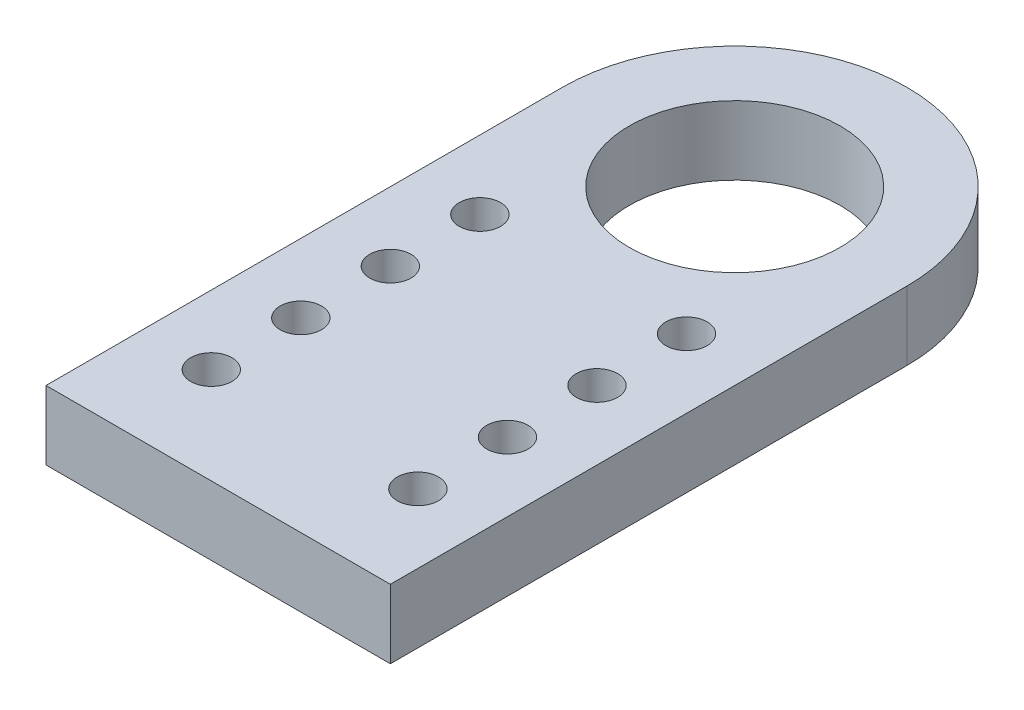
ISO-10303-21;
HEADER;
FILE_DESCRIPTION(('STEP AP214'),'2;1');
FILE_NAME('part.step','',(''),(''),'','','');
FILE_SCHEMA(('AUTOMOTIVE_DESIGN { 1 0 10303 214 1 1 1 1 }'));
ENDSEC;
DATA;
#1=APPLICATION_CONTEXT('core data for automotive mechanical design processes');
#2=APPLICATION_PROTOCOL_DEFINITION('international standard','automotive_design',2000,#1);
#3=PRODUCT_CONTEXT('',#1,'mechanical');
#4=PRODUCT('Part','Part','',(#3));
#5=PRODUCT_RELATED_PRODUCT_CATEGORY('part','',(#4));
#6=PRODUCT_DEFINITION_FORMATION('','',#4);
#7=PRODUCT_DEFINITION_CONTEXT('part definition',#1,'design');
#8=PRODUCT_DEFINITION('design','',#6,#7);
#9=PRODUCT_DEFINITION_SHAPE('','',#8);
#10=(LENGTH_UNIT() NAMED_UNIT(*) SI_UNIT(.MILLI.,.METRE.));
#11=(NAMED_UNIT(*) PLANE_ANGLE_UNIT() SI_UNIT($,.RADIAN.));
#12=(NAMED_UNIT(*) SI_UNIT($,.STERADIAN.) SOLID_ANGLE_UNIT());
#13=UNCERTAINTY_MEASURE_WITH_UNIT(LENGTH_MEASURE(1.E-05),#10,'distance_accuracy_value','');
#14=(GEOMETRIC_REPRESENTATION_CONTEXT(3) GLOBAL_UNCERTAINTY_ASSIGNED_CONTEXT((#13)) GLOBAL_UNIT_ASSIGNED_CONTEXT((#10,
#11,#12)) REPRESENTATION_CONTEXT('',''));
#15=CARTESIAN_POINT('',(0.,0.,0.));
#16=DIRECTION('',(0.,0.,1.));
#17=DIRECTION('',(1.,0.,0.));
#18=AXIS2_PLACEMENT_3D('',#15,#16,#17);
#19=CARTESIAN_POINT('',(0.,5.,-15.8522336769759));
#20=DIRECTION('',(0.,1.,0.));
#21=DIRECTION('',(0.,0.,1.));
#22=AXIS2_PLACEMENT_3D('',#19,#20,#21);
#23=PLANE('',#22);
#24=CARTESIAN_POINT('',(-7.5,5.,-4.85223367697595));
#25=DIRECTION('',(0.,1.,0.));
#26=DIRECTION('',(0.,0.,1.));
#27=AXIS2_PLACEMENT_3D('',#24,#25,#26);
#28=CIRCLE('',#27,1.5);
#29=CARTESIAN_POINT('',(-7.5,5.,-3.35223367697595));
#30=VERTEX_POINT('',#29);
#31=EDGE_CURVE('E153',#30,#30,#28,.T.);
#32=ORIENTED_EDGE('',*,*,#31,.F.);
#33=EDGE_LOOP('',(#32));
#34=FACE_BOUND('',#33,.T.);
#35=CARTESIAN_POINT('',(-7.5,5.,1.64776632302405));
#36=DIRECTION('',(0.,1.,0.));
#37=DIRECTION('',(0.,0.,1.));
#38=AXIS2_PLACEMENT_3D('',#35,#36,#37);
#39=CIRCLE('',#38,1.5);
#40=CARTESIAN_POINT('',(-7.5,5.,3.14776632302405));
#41=VERTEX_POINT('',#40);
#42=EDGE_CURVE('E141',#41,#41,#39,.T.);
#43=ORIENTED_EDGE('',*,*,#42,.F.);
#44=EDGE_LOOP('',(#43));
#45=FACE_BOUND('',#44,.T.);
#46=CARTESIAN_POINT('',(-7.5,5.,8.14776632302405));
#47=DIRECTION('',(0.,1.,0.));
#48=DIRECTION('',(0.,0.,1.));
#49=AXIS2_PLACEMENT_3D('',#46,#47,#48);
#50=CIRCLE('',#49,1.5);
#51=CARTESIAN_POINT('',(-7.5,5.,9.64776632302405));
#52=VERTEX_POINT('',#51);
#53=EDGE_CURVE('E129',#52,#52,#50,.T.);
#54=ORIENTED_EDGE('',*,*,#53,.F.);
#55=EDGE_LOOP('',(#54));
#56=FACE_BOUND('',#55,.T.);
#57=CARTESIAN_POINT('',(0.,5.,-15.8522336769759));
#58=DIRECTION('',(0.,1.,0.));
#59=DIRECTION('',(0.,0.,1.));
#60=AXIS2_PLACEMENT_3D('',#57,#58,#59);
#61=CIRCLE('',#60,7.65);
#62=CARTESIAN_POINT('',(0.,5.,-8.20223367697593));
#63=VERTEX_POINT('',#62);
#64=EDGE_CURVE('E117',#63,#63,#61,.T.);
#65=ORIENTED_EDGE('',*,*,#64,.F.);
#66=EDGE_LOOP('',(#65));
#67=FACE_BOUND('',#66,.T.);
#68=CARTESIAN_POINT('',(0.,5.,-15.8522336769759));
#69=DIRECTION('',(0.,1.,0.));
#70=DIRECTION('',(0.,0.,1.));
#71=AXIS2_PLACEMENT_3D('',#68,#69,#70);
#72=CIRCLE('',#71,12.5);
#73=CARTESIAN_POINT('',(12.5,5.,-15.8522336769759));
#74=VERTEX_POINT('',#73);
#75=CARTESIAN_POINT('',(-12.5,5.,-15.8522336769759));
#76=VERTEX_POINT('',#75);
#77=EDGE_CURVE('E87',#74,#76,#72,.T.);
#78=ORIENTED_EDGE('',*,*,#77,.T.);
#79=DIRECTION('',(0.,0.,1.));
#80=VECTOR('',#79,1.);
#81=CARTESIAN_POINT('',(-12.5,5.,-15.8522336769759));
#82=LINE('',#81,#80);
#83=CARTESIAN_POINT('',(-12.5,5.,21.6477663230241));
#84=VERTEX_POINT('',#83);
#85=EDGE_CURVE('E82',#76,#84,#82,.T.);
#86=ORIENTED_EDGE('',*,*,#85,.T.);
#87=DIRECTION('',(1.,0.,0.));
#88=VECTOR('',#87,1.);
#89=CARTESIAN_POINT('',(-12.5,5.,21.6477663230241));
#90=LINE('',#89,#88);
#91=CARTESIAN_POINT('',(12.5,5.,21.6477663230241));
#92=VERTEX_POINT('',#91);
#93=EDGE_CURVE('E85',#84,#92,#90,.T.);
#94=ORIENTED_EDGE('',*,*,#93,.T.);
#95=DIRECTION('',(0.,0.,-1.));
#96=VECTOR('',#95,1.);
#97=CARTESIAN_POINT('',(12.5,5.,21.6477663230241));
#98=LINE('',#97,#96);
#99=EDGE_CURVE('E52',#92,#74,#98,.T.);
#100=ORIENTED_EDGE('',*,*,#99,.T.);
#101=EDGE_LOOP('',(#78,#86,#94,#100));
#102=FACE_BOUND('',#101,.T.);
#103=CARTESIAN_POINT('',(-7.5,5.,14.6477663230241));
#104=DIRECTION('',(0.,1.,0.));
#105=DIRECTION('',(0.,0.,1.));
#106=AXIS2_PLACEMENT_3D('',#103,#104,#105);
#107=CIRCLE('',#106,1.5);
#108=CARTESIAN_POINT('',(-7.5,5.,16.1477663230241));
#109=VERTEX_POINT('',#108);
#110=EDGE_CURVE('E102',#109,#109,#107,.T.);
#111=ORIENTED_EDGE('',*,*,#110,.F.);
#112=EDGE_LOOP('',(#111));
#113=FACE_BOUND('',#112,.T.);
#114=CARTESIAN_POINT('',(7.5,5.,14.6477663230241));
#115=DIRECTION('',(0.,1.,0.));
#116=DIRECTION('',(0.,0.,1.));
#117=AXIS2_PLACEMENT_3D('',#114,#115,#116);
#118=CIRCLE('',#117,1.5);
#119=CARTESIAN_POINT('',(7.5,5.,16.1477663230241));
#120=VERTEX_POINT('',#119);
#121=EDGE_CURVE('E123',#120,#120,#118,.T.);
#122=ORIENTED_EDGE('',*,*,#121,.F.);
#123=EDGE_LOOP('',(#122));
#124=FACE_BOUND('',#123,.T.);
#125=CARTESIAN_POINT('',(7.5,5.,8.14776632302406));
#126=DIRECTION('',(0.,1.,0.));
#127=DIRECTION('',(0.,0.,1.));
#128=AXIS2_PLACEMENT_3D('',#125,#126,#127);
#129=CIRCLE('',#128,1.5);
#130=CARTESIAN_POINT('',(7.5,5.,9.64776632302406));
#131=VERTEX_POINT('',#130);
#132=EDGE_CURVE('E135',#131,#131,#129,.T.);
#133=ORIENTED_EDGE('',*,*,#132,.F.);
#134=EDGE_LOOP('',(#133));
#135=FACE_BOUND('',#134,.T.);
#136=CARTESIAN_POINT('',(7.5,5.,1.64776632302405));
#137=DIRECTION('',(0.,1.,0.));
#138=DIRECTION('',(0.,0.,1.));
#139=AXIS2_PLACEMENT_3D('',#136,#137,#138);
#140=CIRCLE('',#139,1.5);
#141=CARTESIAN_POINT('',(7.5,5.,3.14776632302405));
#142=VERTEX_POINT('',#141);
#143=EDGE_CURVE('E147',#142,#142,#140,.T.);
#144=ORIENTED_EDGE('',*,*,#143,.F.);
#145=EDGE_LOOP('',(#144));
#146=FACE_BOUND('',#145,.T.);
#147=CARTESIAN_POINT('',(7.5,5.,-4.85223367697595));
#148=DIRECTION('',(0.,1.,0.));
#149=DIRECTION('',(0.,0.,1.));
#150=AXIS2_PLACEMENT_3D('',#147,#148,#149);
#151=CIRCLE('',#150,1.5);
#152=CARTESIAN_POINT('',(7.5,5.,-3.35223367697595));
#153=VERTEX_POINT('',#152);
#154=EDGE_CURVE('E159',#153,#153,#151,.T.);
#155=ORIENTED_EDGE('',*,*,#154,.F.);
#156=EDGE_LOOP('',(#155));
#157=FACE_BOUND('',#156,.T.);
#158=ADVANCED_FACE('F35',(#34,#45,#56,#67,#102,#113,#124,#135,#146,#157),#23,.T.);
#159=CARTESIAN_POINT('',(0.,0.,-15.8522336769759));
#160=DIRECTION('',(0.,1.,0.));
#161=DIRECTION('',(0.,0.,1.));
#162=AXIS2_PLACEMENT_3D('',#159,#160,#161);
#163=PLANE('',#162);
#164=CARTESIAN_POINT('',(0.,0.,-15.8522336769759));
#165=DIRECTION('',(0.,1.,0.));
#166=DIRECTION('',(0.,0.,1.));
#167=AXIS2_PLACEMENT_3D('',#164,#165,#166);
#168=CIRCLE('',#167,12.5);
#169=CARTESIAN_POINT('',(12.5,0.,-15.8522336769759));
#170=VERTEX_POINT('',#169);
#171=CARTESIAN_POINT('',(-12.5,0.,-15.8522336769759));
#172=VERTEX_POINT('',#171);
#173=EDGE_CURVE('E99',#170,#172,#168,.T.);
#174=ORIENTED_EDGE('',*,*,#173,.F.);
#175=DIRECTION('',(0.,0.,-1.));
#176=VECTOR('',#175,1.);
#177=CARTESIAN_POINT('',(12.5,0.,21.6477663230241));
#178=LINE('',#177,#176);
#179=CARTESIAN_POINT('',(12.5,0.,21.6477663230241));
#180=VERTEX_POINT('',#179);
#181=EDGE_CURVE('E75',#180,#170,#178,.T.);
#182=ORIENTED_EDGE('',*,*,#181,.F.);
#183=DIRECTION('',(1.,0.,0.));
#184=VECTOR('',#183,1.);
#185=CARTESIAN_POINT('',(-12.5,0.,21.6477663230241));
#186=LINE('',#185,#184);
#187=CARTESIAN_POINT('',(-12.5,0.,21.6477663230241));
#188=VERTEX_POINT('',#187);
#189=EDGE_CURVE('E69',#188,#180,#186,.T.);
#190=ORIENTED_EDGE('',*,*,#189,.F.);
#191=DIRECTION('',(0.,0.,1.));
#192=VECTOR('',#191,1.);
#193=CARTESIAN_POINT('',(-12.5,0.,-15.8522336769759));
#194=LINE('',#193,#192);
#195=EDGE_CURVE('E91',#172,#188,#194,.T.);
#196=ORIENTED_EDGE('',*,*,#195,.F.);
#197=EDGE_LOOP('',(#174,#182,#190,#196));
#198=FACE_BOUND('',#197,.T.);
#199=CARTESIAN_POINT('',(-7.5,0.,14.6477663230241));
#200=DIRECTION('',(0.,1.,0.));
#201=DIRECTION('',(0.,0.,1.));
#202=AXIS2_PLACEMENT_3D('',#199,#200,#201);
#203=CIRCLE('',#202,1.5);
#204=CARTESIAN_POINT('',(-7.5,0.,16.1477663230241));
#205=VERTEX_POINT('',#204);
#206=EDGE_CURVE('E114',#205,#205,#203,.T.);
#207=ORIENTED_EDGE('',*,*,#206,.T.);
#208=EDGE_LOOP('',(#207));
#209=FACE_BOUND('',#208,.T.);
#210=CARTESIAN_POINT('',(0.,0.,-15.8522336769759));
#211=DIRECTION('',(0.,1.,0.));
#212=DIRECTION('',(0.,0.,1.));
#213=AXIS2_PLACEMENT_3D('',#210,#211,#212);
#214=CIRCLE('',#213,7.65);
#215=CARTESIAN_POINT('',(0.,0.,-8.20223367697593));
#216=VERTEX_POINT('',#215);
#217=EDGE_CURVE('E120',#216,#216,#214,.T.);
#218=ORIENTED_EDGE('',*,*,#217,.T.);
#219=EDGE_LOOP('',(#218));
#220=FACE_BOUND('',#219,.T.);
#221=CARTESIAN_POINT('',(7.5,0.,14.6477663230241));
#222=DIRECTION('',(0.,1.,0.));
#223=DIRECTION('',(0.,0.,1.));
#224=AXIS2_PLACEMENT_3D('',#221,#222,#223);
#225=CIRCLE('',#224,1.5);
#226=CARTESIAN_POINT('',(7.5,0.,16.1477663230241));
#227=VERTEX_POINT('',#226);
#228=EDGE_CURVE('E126',#227,#227,#225,.T.);
#229=ORIENTED_EDGE('',*,*,#228,.T.);
#230=EDGE_LOOP('',(#229));
#231=FACE_BOUND('',#230,.T.);
#232=CARTESIAN_POINT('',(-7.5,0.,8.14776632302405));
#233=DIRECTION('',(0.,1.,0.));
#234=DIRECTION('',(0.,0.,1.));
#235=AXIS2_PLACEMENT_3D('',#232,#233,#234);
#236=CIRCLE('',#235,1.5);
#237=CARTESIAN_POINT('',(-7.5,0.,9.64776632302405));
#238=VERTEX_POINT('',#237);
#239=EDGE_CURVE('E132',#238,#238,#236,.T.);
#240=ORIENTED_EDGE('',*,*,#239,.T.);
#241=EDGE_LOOP('',(#240));
#242=FACE_BOUND('',#241,.T.);
#243=CARTESIAN_POINT('',(7.5,0.,8.14776632302406));
#244=DIRECTION('',(0.,1.,0.));
#245=DIRECTION('',(0.,0.,1.));
#246=AXIS2_PLACEMENT_3D('',#243,#244,#245);
#247=CIRCLE('',#246,1.5);
#248=CARTESIAN_POINT('',(7.5,0.,9.64776632302406));
#249=VERTEX_POINT('',#248);
#250=EDGE_CURVE('E138',#249,#249,#247,.T.);
#251=ORIENTED_EDGE('',*,*,#250,.T.);
#252=EDGE_LOOP('',(#251));
#253=FACE_BOUND('',#252,.T.);
#254=CARTESIAN_POINT('',(-7.5,0.,1.64776632302405));
#255=DIRECTION('',(0.,1.,0.));
#256=DIRECTION('',(0.,0.,1.));
#257=AXIS2_PLACEMENT_3D('',#254,#255,#256);
#258=CIRCLE('',#257,1.5);
#259=CARTESIAN_POINT('',(-7.5,0.,3.14776632302405));
#260=VERTEX_POINT('',#259);
#261=EDGE_CURVE('E144',#260,#260,#258,.T.);
#262=ORIENTED_EDGE('',*,*,#261,.T.);
#263=EDGE_LOOP('',(#262));
#264=FACE_BOUND('',#263,.T.);
#265=CARTESIAN_POINT('',(7.5,0.,1.64776632302405));
#266=DIRECTION('',(0.,1.,0.));
#267=DIRECTION('',(0.,0.,1.));
#268=AXIS2_PLACEMENT_3D('',#265,#266,#267);
#269=CIRCLE('',#268,1.5);
#270=CARTESIAN_POINT('',(7.5,0.,3.14776632302405));
#271=VERTEX_POINT('',#270);
#272=EDGE_CURVE('E150',#271,#271,#269,.T.);
#273=ORIENTED_EDGE('',*,*,#272,.T.);
#274=EDGE_LOOP('',(#273));
#275=FACE_BOUND('',#274,.T.);
#276=CARTESIAN_POINT('',(-7.5,0.,-4.85223367697595));
#277=DIRECTION('',(0.,1.,0.));
#278=DIRECTION('',(0.,0.,1.));
#279=AXIS2_PLACEMENT_3D('',#276,#277,#278);
#280=CIRCLE('',#279,1.5);
#281=CARTESIAN_POINT('',(-7.5,0.,-3.35223367697595));
#282=VERTEX_POINT('',#281);
#283=EDGE_CURVE('E156',#282,#282,#280,.T.);
#284=ORIENTED_EDGE('',*,*,#283,.T.);
#285=EDGE_LOOP('',(#284));
#286=FACE_BOUND('',#285,.T.);
#287=CARTESIAN_POINT('',(7.5,0.,-4.85223367697595));
#288=DIRECTION('',(0.,1.,0.));
#289=DIRECTION('',(0.,0.,1.));
#290=AXIS2_PLACEMENT_3D('',#287,#288,#289);
#291=CIRCLE('',#290,1.5);
#292=CARTESIAN_POINT('',(7.5,0.,-3.35223367697595));
#293=VERTEX_POINT('',#292);
#294=EDGE_CURVE('E162',#293,#293,#291,.T.);
#295=ORIENTED_EDGE('',*,*,#294,.T.);
#296=EDGE_LOOP('',(#295));
#297=FACE_BOUND('',#296,.T.);
#298=ADVANCED_FACE('F110',(#198,#209,#220,#231,#242,#253,#264,#275,#286,#297),#163,.F.);
#299=CARTESIAN_POINT('',(0.,5.,-15.8522336769759));
#300=DIRECTION('',(0.,-1.,0.));
#301=DIRECTION('',(0.,0.,-1.));
#302=AXIS2_PLACEMENT_3D('',#299,#300,#301);
#303=CYLINDRICAL_SURFACE('',#302,12.5);
#304=ORIENTED_EDGE('',*,*,#173,.T.);
#305=DIRECTION('',(0.,-1.,0.));
#306=VECTOR('',#305,1.);
#307=CARTESIAN_POINT('',(-12.5,5.,-15.8522336769759));
#308=LINE('',#307,#306);
#309=EDGE_CURVE('E11',#76,#172,#308,.T.);
#310=ORIENTED_EDGE('',*,*,#309,.F.);
#311=ORIENTED_EDGE('',*,*,#77,.F.);
#312=DIRECTION('',(0.,-1.,0.));
#313=VECTOR('',#312,1.);
#314=CARTESIAN_POINT('',(12.5,5.,-15.8522336769759));
#315=LINE('',#314,#313);
#316=EDGE_CURVE('E95',#74,#170,#315,.T.);
#317=ORIENTED_EDGE('',*,*,#316,.T.);
#318=EDGE_LOOP('',(#304,#310,#311,#317));
#319=FACE_BOUND('',#318,.T.);
#320=ADVANCED_FACE('F37',(#319),#303,.T.);
#321=CARTESIAN_POINT('',(-12.5,5.,-15.8522336769759));
#322=DIRECTION('',(1.,0.,0.));
#323=DIRECTION('',(0.,0.,-1.));
#324=AXIS2_PLACEMENT_3D('',#321,#322,#323);
#325=PLANE('',#324);
#326=ORIENTED_EDGE('',*,*,#195,.T.);
#327=DIRECTION('',(0.,-1.,0.));
#328=VECTOR('',#327,1.);
#329=CARTESIAN_POINT('',(-12.5,5.,21.6477663230241));
#330=LINE('',#329,#328);
#331=EDGE_CURVE('E44',#84,#188,#330,.T.);
#332=ORIENTED_EDGE('',*,*,#331,.F.);
#333=ORIENTED_EDGE('',*,*,#85,.F.);
#334=ORIENTED_EDGE('',*,*,#309,.T.);
#335=EDGE_LOOP('',(#326,#332,#333,#334));
#336=FACE_BOUND('',#335,.T.);
#337=ADVANCED_FACE('F90',(#336),#325,.F.);
#338=CARTESIAN_POINT('',(-12.5,5.,21.6477663230241));
#339=DIRECTION('',(0.,0.,-1.));
#340=DIRECTION('',(-1.,0.,0.));
#341=AXIS2_PLACEMENT_3D('',#338,#339,#340);
#342=PLANE('',#341);
#343=ORIENTED_EDGE('',*,*,#189,.T.);
#344=DIRECTION('',(0.,-1.,0.));
#345=VECTOR('',#344,1.);
#346=CARTESIAN_POINT('',(12.5,5.,21.6477663230241));
#347=LINE('',#346,#345);
#348=EDGE_CURVE('E92',#92,#180,#347,.T.);
#349=ORIENTED_EDGE('',*,*,#348,.F.);
#350=ORIENTED_EDGE('',*,*,#93,.F.);
#351=ORIENTED_EDGE('',*,*,#331,.T.);
#352=EDGE_LOOP('',(#343,#349,#350,#351));
#353=FACE_BOUND('',#352,.T.);
#354=ADVANCED_FACE('F93',(#353),#342,.F.);
#355=CARTESIAN_POINT('',(12.5,5.,21.6477663230241));
#356=DIRECTION('',(-1.,0.,0.));
#357=DIRECTION('',(0.,0.,1.));
#358=AXIS2_PLACEMENT_3D('',#355,#356,#357);
#359=PLANE('',#358);
#360=ORIENTED_EDGE('',*,*,#181,.T.);
#361=ORIENTED_EDGE('',*,*,#316,.F.);
#362=ORIENTED_EDGE('',*,*,#99,.F.);
#363=ORIENTED_EDGE('',*,*,#348,.T.);
#364=EDGE_LOOP('',(#360,#361,#362,#363));
#365=FACE_BOUND('',#364,.T.);
#366=ADVANCED_FACE('F107',(#365),#359,.F.);
#367=CARTESIAN_POINT('',(-7.5,5.,14.6477663230241));
#368=DIRECTION('',(0.,-1.,0.));
#369=DIRECTION('',(0.,0.,-1.));
#370=AXIS2_PLACEMENT_3D('',#367,#368,#369);
#371=CYLINDRICAL_SURFACE('',#370,1.5);
#372=ORIENTED_EDGE('',*,*,#110,.T.);
#373=EDGE_LOOP('',(#372));
#374=FACE_BOUND('',#373,.T.);
#375=ORIENTED_EDGE('',*,*,#206,.F.);
#376=EDGE_LOOP('',(#375));
#377=FACE_BOUND('',#376,.T.);
#378=ADVANCED_FACE('F181',(#374,#377),#371,.F.);
#379=CARTESIAN_POINT('',(0.,5.,-15.8522336769759));
#380=DIRECTION('',(0.,-1.,0.));
#381=DIRECTION('',(0.,0.,-1.));
#382=AXIS2_PLACEMENT_3D('',#379,#380,#381);
#383=CYLINDRICAL_SURFACE('',#382,7.65);
#384=ORIENTED_EDGE('',*,*,#64,.T.);
#385=EDGE_LOOP('',(#384));
#386=FACE_BOUND('',#385,.T.);
#387=ORIENTED_EDGE('',*,*,#217,.F.);
#388=EDGE_LOOP('',(#387));
#389=FACE_BOUND('',#388,.T.);
#390=ADVANCED_FACE('F227',(#386,#389),#383,.F.);
#391=CARTESIAN_POINT('',(7.5,5.,14.6477663230241));
#392=DIRECTION('',(0.,-1.,0.));
#393=DIRECTION('',(0.,0.,-1.));
#394=AXIS2_PLACEMENT_3D('',#391,#392,#393);
#395=CYLINDRICAL_SURFACE('',#394,1.5);
#396=ORIENTED_EDGE('',*,*,#121,.T.);
#397=EDGE_LOOP('',(#396));
#398=FACE_BOUND('',#397,.T.);
#399=ORIENTED_EDGE('',*,*,#228,.F.);
#400=EDGE_LOOP('',(#399));
#401=FACE_BOUND('',#400,.T.);
#402=ADVANCED_FACE('F235',(#398,#401),#395,.F.);
#403=CARTESIAN_POINT('',(-7.5,5.,8.14776632302405));
#404=DIRECTION('',(0.,-1.,0.));
#405=DIRECTION('',(0.,0.,-1.));
#406=AXIS2_PLACEMENT_3D('',#403,#404,#405);
#407=CYLINDRICAL_SURFACE('',#406,1.5);
#408=ORIENTED_EDGE('',*,*,#53,.T.);
#409=EDGE_LOOP('',(#408));
#410=FACE_BOUND('',#409,.T.);
#411=ORIENTED_EDGE('',*,*,#239,.F.);
#412=EDGE_LOOP('',(#411));
#413=FACE_BOUND('',#412,.T.);
#414=ADVANCED_FACE('F243',(#410,#413),#407,.F.);
#415=CARTESIAN_POINT('',(7.5,5.,8.14776632302406));
#416=DIRECTION('',(0.,-1.,0.));
#417=DIRECTION('',(0.,0.,-1.));
#418=AXIS2_PLACEMENT_3D('',#415,#416,#417);
#419=CYLINDRICAL_SURFACE('',#418,1.5);
#420=ORIENTED_EDGE('',*,*,#132,.T.);
#421=EDGE_LOOP('',(#420));
#422=FACE_BOUND('',#421,.T.);
#423=ORIENTED_EDGE('',*,*,#250,.F.);
#424=EDGE_LOOP('',(#423));
#425=FACE_BOUND('',#424,.T.);
#426=ADVANCED_FACE('F252',(#422,#425),#419,.F.);
#427=CARTESIAN_POINT('',(-7.5,5.,1.64776632302405));
#428=DIRECTION('',(0.,-1.,0.));
#429=DIRECTION('',(0.,0.,-1.));
#430=AXIS2_PLACEMENT_3D('',#427,#428,#429);
#431=CYLINDRICAL_SURFACE('',#430,1.5);
#432=ORIENTED_EDGE('',*,*,#42,.T.);
#433=EDGE_LOOP('',(#432));
#434=FACE_BOUND('',#433,.T.);
#435=ORIENTED_EDGE('',*,*,#261,.F.);
#436=EDGE_LOOP('',(#435));
#437=FACE_BOUND('',#436,.T.);
#438=ADVANCED_FACE('F261',(#434,#437),#431,.F.);
#439=CARTESIAN_POINT('',(7.5,5.,1.64776632302405));
#440=DIRECTION('',(0.,-1.,0.));
#441=DIRECTION('',(0.,0.,-1.));
#442=AXIS2_PLACEMENT_3D('',#439,#440,#441);
#443=CYLINDRICAL_SURFACE('',#442,1.5);
#444=ORIENTED_EDGE('',*,*,#143,.T.);
#445=EDGE_LOOP('',(#444));
#446=FACE_BOUND('',#445,.T.);
#447=ORIENTED_EDGE('',*,*,#272,.F.);
#448=EDGE_LOOP('',(#447));
#449=FACE_BOUND('',#448,.T.);
#450=ADVANCED_FACE('F270',(#446,#449),#443,.F.);
#451=CARTESIAN_POINT('',(-7.5,5.,-4.85223367697595));
#452=DIRECTION('',(0.,-1.,0.));
#453=DIRECTION('',(0.,0.,-1.));
#454=AXIS2_PLACEMENT_3D('',#451,#452,#453);
#455=CYLINDRICAL_SURFACE('',#454,1.5);
#456=ORIENTED_EDGE('',*,*,#31,.T.);
#457=EDGE_LOOP('',(#456));
#458=FACE_BOUND('',#457,.T.);
#459=ORIENTED_EDGE('',*,*,#283,.F.);
#460=EDGE_LOOP('',(#459));
#461=FACE_BOUND('',#460,.T.);
#462=ADVANCED_FACE('F279',(#458,#461),#455,.F.);
#463=CARTESIAN_POINT('',(7.5,5.,-4.85223367697595));
#464=DIRECTION('',(0.,-1.,0.));
#465=DIRECTION('',(0.,0.,-1.));
#466=AXIS2_PLACEMENT_3D('',#463,#464,#465);
#467=CYLINDRICAL_SURFACE('',#466,1.5);
#468=ORIENTED_EDGE('',*,*,#154,.T.);
#469=EDGE_LOOP('',(#468));
#470=FACE_BOUND('',#469,.T.);
#471=ORIENTED_EDGE('',*,*,#294,.F.);
#472=EDGE_LOOP('',(#471));
#473=FACE_BOUND('',#472,.T.);
#474=ADVANCED_FACE('F168',(#470,#473),#467,.F.);
#475=CLOSED_SHELL('',(#158,#298,#320,#337,#354,#366,#378,#390,#402,#414,#426,#438,#450,#462,#474));
#476=MANIFOLD_SOLID_BREP('B2',#475);
#477=ADVANCED_BREP_SHAPE_REPRESENTATION('',(#18,#476),#14);
#478=SHAPE_DEFINITION_REPRESENTATION(#9,#477);
ENDSEC;
END-ISO-10303-21;
